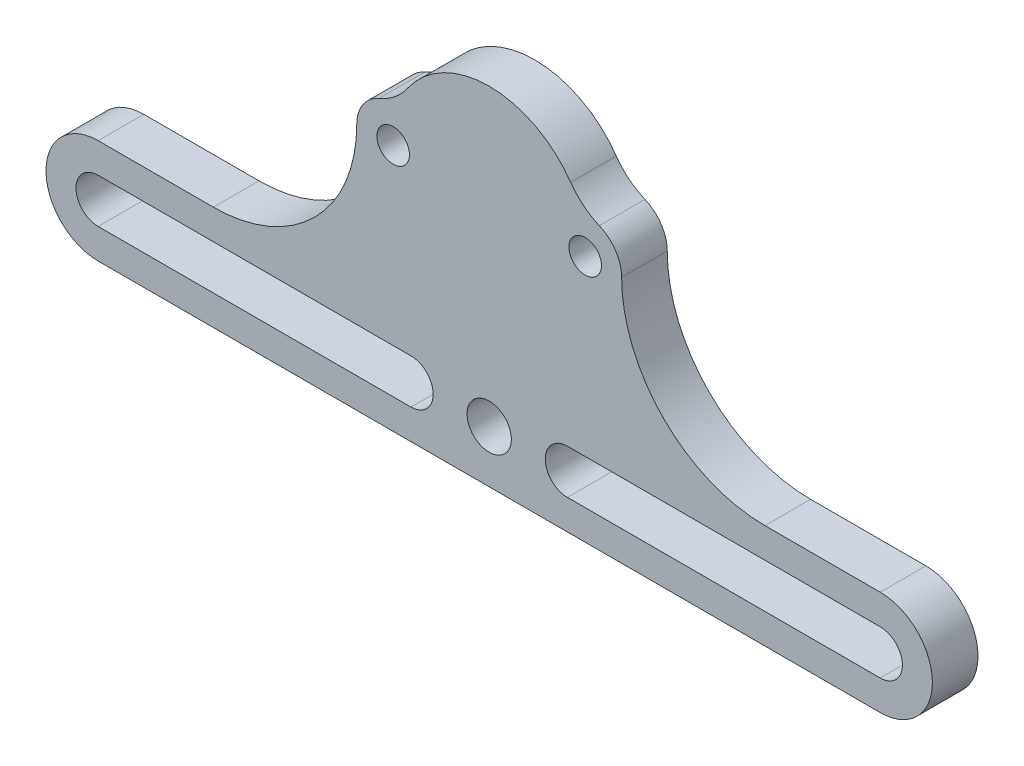
ISO-10303-21;
HEADER;
FILE_DESCRIPTION(('STEP AP214'),'2;1');
FILE_NAME('part.step','',(''),(''),'','','');
FILE_SCHEMA(('AUTOMOTIVE_DESIGN { 1 0 10303 214 1 1 1 1 }'));
ENDSEC;
DATA;
#1=APPLICATION_CONTEXT('core data for automotive mechanical design processes');
#2=APPLICATION_PROTOCOL_DEFINITION('international standard','automotive_design',2000,#1);
#3=PRODUCT_CONTEXT('',#1,'mechanical');
#4=PRODUCT('Part','Part','',(#3));
#5=PRODUCT_RELATED_PRODUCT_CATEGORY('part','',(#4));
#6=PRODUCT_DEFINITION_FORMATION('','',#4);
#7=PRODUCT_DEFINITION_CONTEXT('part definition',#1,'design');
#8=PRODUCT_DEFINITION('design','',#6,#7);
#9=PRODUCT_DEFINITION_SHAPE('','',#8);
#10=(LENGTH_UNIT() NAMED_UNIT(*) SI_UNIT(.MILLI.,.METRE.));
#11=(NAMED_UNIT(*) PLANE_ANGLE_UNIT() SI_UNIT($,.RADIAN.));
#12=(NAMED_UNIT(*) SI_UNIT($,.STERADIAN.) SOLID_ANGLE_UNIT());
#13=UNCERTAINTY_MEASURE_WITH_UNIT(LENGTH_MEASURE(1.E-05),#10,'distance_accuracy_value','');
#14=(GEOMETRIC_REPRESENTATION_CONTEXT(3) GLOBAL_UNCERTAINTY_ASSIGNED_CONTEXT((#13)) GLOBAL_UNIT_ASSIGNED_CONTEXT((#10,
#11,#12)) REPRESENTATION_CONTEXT('',''));
#15=CARTESIAN_POINT('',(0.,0.,0.));
#16=DIRECTION('',(0.,0.,1.));
#17=DIRECTION('',(1.,0.,0.));
#18=AXIS2_PLACEMENT_3D('',#15,#16,#17);
#19=CARTESIAN_POINT('',(-30.,-15.,3.50000000000001));
#20=DIRECTION('',(0.,0.,-1.));
#21=DIRECTION('',(-1.,0.,0.));
#22=AXIS2_PLACEMENT_3D('',#19,#20,#21);
#23=PLANE('',#22);
#24=CARTESIAN_POINT('',(-30.,-15.,3.50000000000001));
#25=DIRECTION('',(0.,0.,1.));
#26=DIRECTION('',(1.,0.,0.));
#27=AXIS2_PLACEMENT_3D('',#24,#25,#26);
#28=CIRCLE('',#27,1.7);
#29=CARTESIAN_POINT('',(-30.,-13.3,3.5));
#30=VERTEX_POINT('',#29);
#31=CARTESIAN_POINT('',(-30.,-16.7,3.50000000000001));
#32=VERTEX_POINT('',#31);
#33=EDGE_CURVE('E233',#30,#32,#28,.T.);
#34=ORIENTED_EDGE('',*,*,#33,.F.);
#35=DIRECTION('',(-1.,0.,0.));
#36=VECTOR('',#35,1.);
#37=CARTESIAN_POINT('',(-30.,-13.3,3.5));
#38=LINE('',#37,#36);
#39=CARTESIAN_POINT('',(-6.,-13.3,3.5));
#40=VERTEX_POINT('',#39);
#41=EDGE_CURVE('E244',#40,#30,#38,.T.);
#42=ORIENTED_EDGE('',*,*,#41,.F.);
#43=CARTESIAN_POINT('',(-6.00000000000001,-15.,3.5));
#44=DIRECTION('',(0.,0.,1.));
#45=DIRECTION('',(1.,0.,0.));
#46=AXIS2_PLACEMENT_3D('',#43,#44,#45);
#47=CIRCLE('',#46,1.7);
#48=CARTESIAN_POINT('',(-6.,-16.7,3.5));
#49=VERTEX_POINT('',#48);
#50=EDGE_CURVE('E240',#49,#40,#47,.T.);
#51=ORIENTED_EDGE('',*,*,#50,.F.);
#52=DIRECTION('',(1.,0.,0.));
#53=VECTOR('',#52,1.);
#54=CARTESIAN_POINT('',(-30.,-16.7,3.50000000000001));
#55=LINE('',#54,#53);
#56=EDGE_CURVE('E236',#32,#49,#55,.T.);
#57=ORIENTED_EDGE('',*,*,#56,.F.);
#58=EDGE_LOOP('',(#34,#42,#51,#57));
#59=FACE_BOUND('',#58,.T.);
#60=CARTESIAN_POINT('',(-30.,-15.,3.50000000000001));
#61=DIRECTION('',(0.,0.,1.));
#62=DIRECTION('',(-1.,0.,0.));
#63=AXIS2_PLACEMENT_3D('',#60,#61,#62);
#64=CIRCLE('',#63,4.);
#65=CARTESIAN_POINT('',(-30.,-11.,3.5));
#66=VERTEX_POINT('',#65);
#67=CARTESIAN_POINT('',(-30.,-19.,3.50000000000005));
#68=VERTEX_POINT('',#67);
#69=EDGE_CURVE('E292',#66,#68,#64,.T.);
#70=ORIENTED_EDGE('',*,*,#69,.T.);
#71=DIRECTION('',(1.,0.,0.));
#72=VECTOR('',#71,1.);
#73=CARTESIAN_POINT('',(-30.,-19.,3.50000000000005));
#74=LINE('',#73,#72);
#75=CARTESIAN_POINT('',(30.,-19.,3.5));
#76=VERTEX_POINT('',#75);
#77=EDGE_CURVE('E296',#68,#76,#74,.T.);
#78=ORIENTED_EDGE('',*,*,#77,.T.);
#79=CARTESIAN_POINT('',(30.,-15.0000000000001,3.5));
#80=DIRECTION('',(0.,0.,1.));
#81=DIRECTION('',(1.,0.,0.));
#82=AXIS2_PLACEMENT_3D('',#79,#80,#81);
#83=CIRCLE('',#82,4.);
#84=CARTESIAN_POINT('',(30.,-11.0000000000001,3.5));
#85=VERTEX_POINT('',#84);
#86=EDGE_CURVE('E300',#76,#85,#83,.T.);
#87=ORIENTED_EDGE('',*,*,#86,.T.);
#88=DIRECTION('',(-1.,0.,0.));
#89=VECTOR('',#88,1.);
#90=CARTESIAN_POINT('',(30.,-11.0000000000001,3.5));
#91=LINE('',#90,#89);
#92=CARTESIAN_POINT('',(21.1600000000001,-11.0000000000001,3.5));
#93=VERTEX_POINT('',#92);
#94=EDGE_CURVE('E303',#85,#93,#91,.T.);
#95=ORIENTED_EDGE('',*,*,#94,.T.);
#96=CARTESIAN_POINT('',(21.1600000000001,0.,3.5));
#97=DIRECTION('',(0.,0.,-1.));
#98=DIRECTION('',(-1.,0.,0.));
#99=AXIS2_PLACEMENT_3D('',#96,#97,#98);
#100=CIRCLE('',#99,11.0000000000001);
#101=CARTESIAN_POINT('',(10.16,0.,3.5));
#102=VERTEX_POINT('',#101);
#103=EDGE_CURVE('E306',#93,#102,#100,.T.);
#104=ORIENTED_EDGE('',*,*,#103,.T.);
#105=CARTESIAN_POINT('',(7.366,0.,3.5));
#106=DIRECTION('',(0.,0.,1.));
#107=DIRECTION('',(1.,0.,0.));
#108=AXIS2_PLACEMENT_3D('',#105,#106,#107);
#109=CIRCLE('',#108,2.794);
#110=CARTESIAN_POINT('',(8.45065628436315,2.57487023843755,3.5));
#111=VERTEX_POINT('',#110);
#112=EDGE_CURVE('E309',#102,#111,#109,.T.);
#113=ORIENTED_EDGE('',*,*,#112,.T.);
#114=CARTESIAN_POINT('',(10.4227586206897,7.25645248967009,3.5));
#115=DIRECTION('',(0.,0.,-1.));
#116=DIRECTION('',(1.,0.,0.));
#117=AXIS2_PLACEMENT_3D('',#114,#115,#116);
#118=CIRCLE('',#117,5.08000130660241);
#119=CARTESIAN_POINT('',(6.25365410024561,4.35387074703213,3.5));
#120=VERTEX_POINT('',#119);
#121=EDGE_CURVE('E312',#111,#120,#118,.T.);
#122=ORIENTED_EDGE('',*,*,#121,.T.);
#123=CARTESIAN_POINT('',(0.,0.,3.5));
#124=DIRECTION('',(0.,0.,1.));
#125=DIRECTION('',(1.,0.,0.));
#126=AXIS2_PLACEMENT_3D('',#123,#124,#125);
#127=CIRCLE('',#126,7.61999738679518);
#128=CARTESIAN_POINT('',(-6.25365302788954,4.3538700005321,3.5));
#129=VERTEX_POINT('',#128);
#130=EDGE_CURVE('E315',#120,#129,#127,.T.);
#131=ORIENTED_EDGE('',*,*,#130,.T.);
#132=CARTESIAN_POINT('',(-10.4227586206897,7.25645248967009,3.49999999999999));
#133=DIRECTION('',(0.,0.,-1.));
#134=DIRECTION('',(1.,0.,0.));
#135=AXIS2_PLACEMENT_3D('',#132,#133,#134);
#136=CIRCLE('',#135,5.08000361067499);
#137=CARTESIAN_POINT('',(-8.45065488236616,2.57486691106946,3.5));
#138=VERTEX_POINT('',#137);
#139=EDGE_CURVE('E318',#129,#138,#136,.T.);
#140=ORIENTED_EDGE('',*,*,#139,.T.);
#141=CARTESIAN_POINT('',(-7.366,0.,3.5));
#142=DIRECTION('',(0.,0.,1.));
#143=DIRECTION('',(1.,0.,0.));
#144=AXIS2_PLACEMENT_3D('',#141,#142,#143);
#145=CIRCLE('',#144,2.79399539185486);
#146=CARTESIAN_POINT('',(-10.1599953918549,0.,3.5));
#147=VERTEX_POINT('',#146);
#148=EDGE_CURVE('E321',#138,#147,#145,.T.);
#149=ORIENTED_EDGE('',*,*,#148,.T.);
#150=CARTESIAN_POINT('',(-21.1599953918549,0.,3.5));
#151=DIRECTION('',(0.,0.,-1.));
#152=DIRECTION('',(1.,0.,0.));
#153=AXIS2_PLACEMENT_3D('',#150,#151,#152);
#154=CIRCLE('',#153,11.0000000000001);
#155=CARTESIAN_POINT('',(-21.1599953918549,-11.,3.50000000000005));
#156=VERTEX_POINT('',#155);
#157=EDGE_CURVE('E324',#147,#156,#154,.T.);
#158=ORIENTED_EDGE('',*,*,#157,.T.);
#159=DIRECTION('',(-1.,0.,0.));
#160=VECTOR('',#159,1.);
#161=CARTESIAN_POINT('',(-30.,-11.,3.5));
#162=LINE('',#161,#160);
#163=EDGE_CURVE('E327',#156,#66,#162,.T.);
#164=ORIENTED_EDGE('',*,*,#163,.T.);
#165=EDGE_LOOP('',(#70,#78,#87,#95,#104,#113,#122,#131,#140,#149,#158,#164));
#166=FACE_BOUND('',#165,.T.);
#167=CARTESIAN_POINT('',(0.,-15.,3.5));
#168=DIRECTION('',(0.,0.,1.));
#169=DIRECTION('',(1.,0.,0.));
#170=AXIS2_PLACEMENT_3D('',#167,#168,#169);
#171=CIRCLE('',#170,1.7);
#172=CARTESIAN_POINT('',(1.7,-15.,3.5));
#173=VERTEX_POINT('',#172);
#174=EDGE_CURVE('E284',#173,#173,#171,.T.);
#175=ORIENTED_EDGE('',*,*,#174,.F.);
#176=EDGE_LOOP('',(#175));
#177=FACE_BOUND('',#176,.T.);
#178=CARTESIAN_POINT('',(7.366,0.,3.5));
#179=DIRECTION('',(0.,0.,1.));
#180=DIRECTION('',(1.,0.,0.));
#181=AXIS2_PLACEMENT_3D('',#178,#179,#180);
#182=CIRCLE('',#181,1.25);
#183=CARTESIAN_POINT('',(8.616,0.,3.5));
#184=VERTEX_POINT('',#183);
#185=EDGE_CURVE('E276',#184,#184,#182,.T.);
#186=ORIENTED_EDGE('',*,*,#185,.F.);
#187=EDGE_LOOP('',(#186));
#188=FACE_BOUND('',#187,.T.);
#189=CARTESIAN_POINT('',(30.,-15.0000000000001,3.5));
#190=DIRECTION('',(0.,0.,1.));
#191=DIRECTION('',(1.,0.,0.));
#192=AXIS2_PLACEMENT_3D('',#189,#190,#191);
#193=CIRCLE('',#192,1.7);
#194=CARTESIAN_POINT('',(30.,-16.7000000000001,3.5));
#195=VERTEX_POINT('',#194);
#196=CARTESIAN_POINT('',(30.,-13.3000000000001,3.5));
#197=VERTEX_POINT('',#196);
#198=EDGE_CURVE('E181',#195,#197,#193,.T.);
#199=ORIENTED_EDGE('',*,*,#198,.F.);
#200=DIRECTION('',(1.,0.,0.));
#201=VECTOR('',#200,1.);
#202=CARTESIAN_POINT('',(30.,-16.7000000000001,3.5));
#203=LINE('',#202,#201);
#204=CARTESIAN_POINT('',(6.00000000000001,-16.7,3.50000000000005));
#205=VERTEX_POINT('',#204);
#206=EDGE_CURVE('E209',#205,#195,#203,.T.);
#207=ORIENTED_EDGE('',*,*,#206,.F.);
#208=CARTESIAN_POINT('',(5.99999999999999,-15.,3.50000000000005));
#209=DIRECTION('',(0.,0.,1.));
#210=DIRECTION('',(1.,0.,0.));
#211=AXIS2_PLACEMENT_3D('',#208,#209,#210);
#212=CIRCLE('',#211,1.7);
#213=CARTESIAN_POINT('',(6.,-13.3,3.5));
#214=VERTEX_POINT('',#213);
#215=EDGE_CURVE('E204',#214,#205,#212,.T.);
#216=ORIENTED_EDGE('',*,*,#215,.F.);
#217=DIRECTION('',(-1.,0.,0.));
#218=VECTOR('',#217,1.);
#219=CARTESIAN_POINT('',(30.,-13.3000000000001,3.5));
#220=LINE('',#219,#218);
#221=EDGE_CURVE('E190',#197,#214,#220,.T.);
#222=ORIENTED_EDGE('',*,*,#221,.F.);
#223=EDGE_LOOP('',(#199,#207,#216,#222));
#224=FACE_BOUND('',#223,.T.);
#225=CARTESIAN_POINT('',(-7.366,0.,3.5));
#226=DIRECTION('',(0.,0.,1.));
#227=DIRECTION('',(1.,0.,0.));
#228=AXIS2_PLACEMENT_3D('',#225,#226,#227);
#229=CIRCLE('',#228,1.25);
#230=CARTESIAN_POINT('',(-6.116,0.,3.5));
#231=VERTEX_POINT('',#230);
#232=EDGE_CURVE('E217',#231,#231,#229,.T.);
#233=ORIENTED_EDGE('',*,*,#232,.F.);
#234=EDGE_LOOP('',(#233));
#235=FACE_BOUND('',#234,.T.);
#236=ADVANCED_FACE('F43',(#59,#166,#177,#188,#224,#235),#23,.F.);
#237=CARTESIAN_POINT('',(-30.,-15.,0.));
#238=DIRECTION('',(0.,0.,-1.));
#239=DIRECTION('',(-1.,0.,0.));
#240=AXIS2_PLACEMENT_3D('',#237,#238,#239);
#241=PLANE('',#240);
#242=DIRECTION('',(1.,0.,0.));
#243=VECTOR('',#242,1.);
#244=CARTESIAN_POINT('',(30.,-16.7000000000001,0.));
#245=LINE('',#244,#243);
#246=CARTESIAN_POINT('',(6.00000000000001,-16.7,0.));
#247=VERTEX_POINT('',#246);
#248=CARTESIAN_POINT('',(30.,-16.7000000000001,0.));
#249=VERTEX_POINT('',#248);
#250=EDGE_CURVE('E191',#247,#249,#245,.T.);
#251=ORIENTED_EDGE('',*,*,#250,.T.);
#252=CARTESIAN_POINT('',(30.,-15.0000000000001,0.));
#253=DIRECTION('',(0.,0.,1.));
#254=DIRECTION('',(1.,0.,0.));
#255=AXIS2_PLACEMENT_3D('',#252,#253,#254);
#256=CIRCLE('',#255,1.7);
#257=CARTESIAN_POINT('',(30.,-13.3000000000001,0.));
#258=VERTEX_POINT('',#257);
#259=EDGE_CURVE('E67',#249,#258,#256,.T.);
#260=ORIENTED_EDGE('',*,*,#259,.T.);
#261=DIRECTION('',(-1.,0.,0.));
#262=VECTOR('',#261,1.);
#263=CARTESIAN_POINT('',(30.,-13.3000000000001,0.));
#264=LINE('',#263,#262);
#265=CARTESIAN_POINT('',(6.00000000000001,-13.3,0.));
#266=VERTEX_POINT('',#265);
#267=EDGE_CURVE('E197',#258,#266,#264,.T.);
#268=ORIENTED_EDGE('',*,*,#267,.T.);
#269=CARTESIAN_POINT('',(6.,-15.,0.));
#270=DIRECTION('',(0.,0.,1.));
#271=DIRECTION('',(1.,0.,0.));
#272=AXIS2_PLACEMENT_3D('',#269,#270,#271);
#273=CIRCLE('',#272,1.7);
#274=EDGE_CURVE('E220',#266,#247,#273,.T.);
#275=ORIENTED_EDGE('',*,*,#274,.T.);
#276=EDGE_LOOP('',(#251,#260,#268,#275));
#277=FACE_BOUND('',#276,.T.);
#278=DIRECTION('',(-1.,0.,0.));
#279=VECTOR('',#278,1.);
#280=CARTESIAN_POINT('',(-30.,-13.3,0.));
#281=LINE('',#280,#279);
#282=CARTESIAN_POINT('',(-5.99999999999999,-13.3,0.));
#283=VERTEX_POINT('',#282);
#284=CARTESIAN_POINT('',(-30.,-13.3,0.));
#285=VERTEX_POINT('',#284);
#286=EDGE_CURVE('E237',#283,#285,#281,.T.);
#287=ORIENTED_EDGE('',*,*,#286,.T.);
#288=CARTESIAN_POINT('',(-30.,-15.,0.));
#289=DIRECTION('',(0.,0.,1.));
#290=DIRECTION('',(1.,0.,0.));
#291=AXIS2_PLACEMENT_3D('',#288,#289,#290);
#292=CIRCLE('',#291,1.7);
#293=CARTESIAN_POINT('',(-30.,-16.7,0.));
#294=VERTEX_POINT('',#293);
#295=EDGE_CURVE('E199',#285,#294,#292,.T.);
#296=ORIENTED_EDGE('',*,*,#295,.T.);
#297=DIRECTION('',(1.,0.,0.));
#298=VECTOR('',#297,1.);
#299=CARTESIAN_POINT('',(-30.,-16.7,0.));
#300=LINE('',#299,#298);
#301=CARTESIAN_POINT('',(-5.99999999999999,-16.7,0.));
#302=VERTEX_POINT('',#301);
#303=EDGE_CURVE('E251',#294,#302,#300,.T.);
#304=ORIENTED_EDGE('',*,*,#303,.T.);
#305=CARTESIAN_POINT('',(-6.,-15.,0.));
#306=DIRECTION('',(0.,0.,1.));
#307=DIRECTION('',(1.,0.,0.));
#308=AXIS2_PLACEMENT_3D('',#305,#306,#307);
#309=CIRCLE('',#308,1.7);
#310=EDGE_CURVE('E255',#302,#283,#309,.T.);
#311=ORIENTED_EDGE('',*,*,#310,.T.);
#312=EDGE_LOOP('',(#287,#296,#304,#311));
#313=FACE_BOUND('',#312,.T.);
#314=CARTESIAN_POINT('',(7.36600000000001,0.,0.));
#315=DIRECTION('',(0.,0.,1.));
#316=DIRECTION('',(1.,0.,0.));
#317=AXIS2_PLACEMENT_3D('',#314,#315,#316);
#318=CIRCLE('',#317,1.25);
#319=CARTESIAN_POINT('',(8.61600000000001,0.,0.));
#320=VERTEX_POINT('',#319);
#321=EDGE_CURVE('E275',#320,#320,#318,.T.);
#322=ORIENTED_EDGE('',*,*,#321,.T.);
#323=EDGE_LOOP('',(#322));
#324=FACE_BOUND('',#323,.T.);
#325=CARTESIAN_POINT('',(-30.,-15.,0.));
#326=DIRECTION('',(0.,0.,1.));
#327=DIRECTION('',(-1.,0.,0.));
#328=AXIS2_PLACEMENT_3D('',#325,#326,#327);
#329=CIRCLE('',#328,4.);
#330=CARTESIAN_POINT('',(-30.,-11.,0.));
#331=VERTEX_POINT('',#330);
#332=CARTESIAN_POINT('',(-30.,-19.,0.));
#333=VERTEX_POINT('',#332);
#334=EDGE_CURVE('E288',#331,#333,#329,.T.);
#335=ORIENTED_EDGE('',*,*,#334,.F.);
#336=DIRECTION('',(-1.,0.,0.));
#337=VECTOR('',#336,1.);
#338=CARTESIAN_POINT('',(-30.,-11.,0.));
#339=LINE('',#338,#337);
#340=CARTESIAN_POINT('',(-21.159995391855,-11.,0.));
#341=VERTEX_POINT('',#340);
#342=EDGE_CURVE('E297',#341,#331,#339,.T.);
#343=ORIENTED_EDGE('',*,*,#342,.F.);
#344=CARTESIAN_POINT('',(-21.1599953918549,0.,0.));
#345=DIRECTION('',(0.,0.,-1.));
#346=DIRECTION('',(1.,0.,0.));
#347=AXIS2_PLACEMENT_3D('',#344,#345,#346);
#348=CIRCLE('',#347,11.0000000000001);
#349=CARTESIAN_POINT('',(-10.1599953918549,0.,0.));
#350=VERTEX_POINT('',#349);
#351=EDGE_CURVE('E361',#350,#341,#348,.T.);
#352=ORIENTED_EDGE('',*,*,#351,.F.);
#353=CARTESIAN_POINT('',(-7.36599999999999,0.,0.));
#354=DIRECTION('',(0.,0.,1.));
#355=DIRECTION('',(1.,0.,0.));
#356=AXIS2_PLACEMENT_3D('',#353,#354,#355);
#357=CIRCLE('',#356,2.79399539185486);
#358=CARTESIAN_POINT('',(-8.45065488236617,2.57486691106946,0.));
#359=VERTEX_POINT('',#358);
#360=EDGE_CURVE('E358',#359,#350,#357,.T.);
#361=ORIENTED_EDGE('',*,*,#360,.F.);
#362=CARTESIAN_POINT('',(-10.4227586206897,7.25645248967009,0.));
#363=DIRECTION('',(0.,0.,-1.));
#364=DIRECTION('',(1.,0.,0.));
#365=AXIS2_PLACEMENT_3D('',#362,#363,#364);
#366=CIRCLE('',#365,5.08000361067499);
#367=CARTESIAN_POINT('',(-6.25365302788953,4.35387000053211,0.));
#368=VERTEX_POINT('',#367);
#369=EDGE_CURVE('E355',#368,#359,#366,.T.);
#370=ORIENTED_EDGE('',*,*,#369,.F.);
#371=CARTESIAN_POINT('',(0.,0.,0.));
#372=DIRECTION('',(0.,0.,1.));
#373=DIRECTION('',(1.,0.,0.));
#374=AXIS2_PLACEMENT_3D('',#371,#372,#373);
#375=CIRCLE('',#374,7.61999738679518);
#376=CARTESIAN_POINT('',(6.25365410024561,4.35387074703213,0.));
#377=VERTEX_POINT('',#376);
#378=EDGE_CURVE('E352',#377,#368,#375,.T.);
#379=ORIENTED_EDGE('',*,*,#378,.F.);
#380=CARTESIAN_POINT('',(10.4227586206897,7.25645248967009,0.));
#381=DIRECTION('',(0.,0.,-1.));
#382=DIRECTION('',(1.,0.,0.));
#383=AXIS2_PLACEMENT_3D('',#380,#381,#382);
#384=CIRCLE('',#383,5.08000130660241);
#385=CARTESIAN_POINT('',(8.45065628436315,2.57487023843755,0.));
#386=VERTEX_POINT('',#385);
#387=EDGE_CURVE('E349',#386,#377,#384,.T.);
#388=ORIENTED_EDGE('',*,*,#387,.F.);
#389=CARTESIAN_POINT('',(7.36600000000001,0.,0.));
#390=DIRECTION('',(0.,0.,1.));
#391=DIRECTION('',(1.,0.,0.));
#392=AXIS2_PLACEMENT_3D('',#389,#390,#391);
#393=CIRCLE('',#392,2.794);
#394=CARTESIAN_POINT('',(10.16,0.,0.));
#395=VERTEX_POINT('',#394);
#396=EDGE_CURVE('E346',#395,#386,#393,.T.);
#397=ORIENTED_EDGE('',*,*,#396,.F.);
#398=CARTESIAN_POINT('',(21.16,0.,0.));
#399=DIRECTION('',(0.,0.,-1.));
#400=DIRECTION('',(-1.,0.,0.));
#401=AXIS2_PLACEMENT_3D('',#398,#399,#400);
#402=CIRCLE('',#401,11.0000000000001);
#403=CARTESIAN_POINT('',(21.16,-11.,0.));
#404=VERTEX_POINT('',#403);
#405=EDGE_CURVE('E343',#404,#395,#402,.T.);
#406=ORIENTED_EDGE('',*,*,#405,.F.);
#407=DIRECTION('',(-1.,0.,0.));
#408=VECTOR('',#407,1.);
#409=CARTESIAN_POINT('',(30.,-11.0000000000001,0.));
#410=LINE('',#409,#408);
#411=CARTESIAN_POINT('',(30.,-11.0000000000001,0.));
#412=VERTEX_POINT('',#411);
#413=EDGE_CURVE('E340',#412,#404,#410,.T.);
#414=ORIENTED_EDGE('',*,*,#413,.F.);
#415=CARTESIAN_POINT('',(30.,-15.0000000000001,0.));
#416=DIRECTION('',(0.,0.,1.));
#417=DIRECTION('',(1.,0.,0.));
#418=AXIS2_PLACEMENT_3D('',#415,#416,#417);
#419=CIRCLE('',#418,4.);
#420=CARTESIAN_POINT('',(30.,-19.,0.));
#421=VERTEX_POINT('',#420);
#422=EDGE_CURVE('E337',#421,#412,#419,.T.);
#423=ORIENTED_EDGE('',*,*,#422,.F.);
#424=DIRECTION('',(1.,0.,0.));
#425=VECTOR('',#424,1.);
#426=CARTESIAN_POINT('',(-30.,-19.,0.));
#427=LINE('',#426,#425);
#428=EDGE_CURVE('E334',#333,#421,#427,.T.);
#429=ORIENTED_EDGE('',*,*,#428,.F.);
#430=EDGE_LOOP('',(#335,#343,#352,#361,#370,#379,#388,#397,#406,#414,#423,#429));
#431=FACE_BOUND('',#430,.T.);
#432=CARTESIAN_POINT('',(0.,-15.,0.));
#433=DIRECTION('',(0.,0.,1.));
#434=DIRECTION('',(1.,0.,0.));
#435=AXIS2_PLACEMENT_3D('',#432,#433,#434);
#436=CIRCLE('',#435,1.7);
#437=CARTESIAN_POINT('',(1.7,-15.,0.));
#438=VERTEX_POINT('',#437);
#439=EDGE_CURVE('E280',#438,#438,#436,.T.);
#440=ORIENTED_EDGE('',*,*,#439,.T.);
#441=EDGE_LOOP('',(#440));
#442=FACE_BOUND('',#441,.T.);
#443=CARTESIAN_POINT('',(-7.36599999999999,0.,0.));
#444=DIRECTION('',(0.,0.,1.));
#445=DIRECTION('',(1.,0.,0.));
#446=AXIS2_PLACEMENT_3D('',#443,#444,#445);
#447=CIRCLE('',#446,1.25);
#448=CARTESIAN_POINT('',(-6.11599999999999,0.,0.));
#449=VERTEX_POINT('',#448);
#450=EDGE_CURVE('E692',#449,#449,#447,.T.);
#451=ORIENTED_EDGE('',*,*,#450,.T.);
#452=EDGE_LOOP('',(#451));
#453=FACE_BOUND('',#452,.T.);
#454=ADVANCED_FACE('F417',(#277,#313,#324,#431,#442,#453),#241,.T.);
#455=CARTESIAN_POINT('',(-30.,-15.,3.50000000000001));
#456=DIRECTION('',(0.,0.,-1.));
#457=DIRECTION('',(-1.,0.,0.));
#458=AXIS2_PLACEMENT_3D('',#455,#456,#457);
#459=CYLINDRICAL_SURFACE('',#458,4.);
#460=ORIENTED_EDGE('',*,*,#334,.T.);
#461=DIRECTION('',(0.,0.,-1.));
#462=VECTOR('',#461,1.);
#463=CARTESIAN_POINT('',(-30.,-19.,3.50000000000005));
#464=LINE('',#463,#462);
#465=EDGE_CURVE('E11',#68,#333,#464,.T.);
#466=ORIENTED_EDGE('',*,*,#465,.F.);
#467=ORIENTED_EDGE('',*,*,#69,.F.);
#468=DIRECTION('',(0.,0.,-1.));
#469=VECTOR('',#468,1.);
#470=CARTESIAN_POINT('',(-30.,-11.,3.5));
#471=LINE('',#470,#469);
#472=EDGE_CURVE('E330',#66,#331,#471,.T.);
#473=ORIENTED_EDGE('',*,*,#472,.T.);
#474=EDGE_LOOP('',(#460,#466,#467,#473));
#475=FACE_BOUND('',#474,.T.);
#476=ADVANCED_FACE('F45',(#475),#459,.T.);
#477=CARTESIAN_POINT('',(-30.,-19.,3.50000000000005));
#478=DIRECTION('',(0.,1.,0.));
#479=DIRECTION('',(0.,0.,1.));
#480=AXIS2_PLACEMENT_3D('',#477,#478,#479);
#481=PLANE('',#480);
#482=ORIENTED_EDGE('',*,*,#428,.T.);
#483=DIRECTION('',(0.,0.,-1.));
#484=VECTOR('',#483,1.);
#485=CARTESIAN_POINT('',(30.,-19.,3.5));
#486=LINE('',#485,#484);
#487=EDGE_CURVE('E52',#76,#421,#486,.T.);
#488=ORIENTED_EDGE('',*,*,#487,.F.);
#489=ORIENTED_EDGE('',*,*,#77,.F.);
#490=ORIENTED_EDGE('',*,*,#465,.T.);
#491=EDGE_LOOP('',(#482,#488,#489,#490));
#492=FACE_BOUND('',#491,.T.);
#493=ADVANCED_FACE('F435',(#492),#481,.F.);
#494=CARTESIAN_POINT('',(30.,-15.0000000000001,3.5));
#495=DIRECTION('',(0.,0.,-1.));
#496=DIRECTION('',(-1.,0.,0.));
#497=AXIS2_PLACEMENT_3D('',#494,#495,#496);
#498=CYLINDRICAL_SURFACE('',#497,4.);
#499=ORIENTED_EDGE('',*,*,#422,.T.);
#500=DIRECTION('',(0.,0.,-1.));
#501=VECTOR('',#500,1.);
#502=CARTESIAN_POINT('',(30.,-11.0000000000001,3.5));
#503=LINE('',#502,#501);
#504=EDGE_CURVE('E401',#85,#412,#503,.T.);
#505=ORIENTED_EDGE('',*,*,#504,.F.);
#506=ORIENTED_EDGE('',*,*,#86,.F.);
#507=ORIENTED_EDGE('',*,*,#487,.T.);
#508=EDGE_LOOP('',(#499,#505,#506,#507));
#509=FACE_BOUND('',#508,.T.);
#510=ADVANCED_FACE('F411',(#509),#498,.T.);
#511=CARTESIAN_POINT('',(30.,-11.0000000000001,3.5));
#512=DIRECTION('',(0.,-1.,0.));
#513=DIRECTION('',(0.,0.,-1.));
#514=AXIS2_PLACEMENT_3D('',#511,#512,#513);
#515=PLANE('',#514);
#516=ORIENTED_EDGE('',*,*,#413,.T.);
#517=DIRECTION('',(0.,0.,-1.));
#518=VECTOR('',#517,1.);
#519=CARTESIAN_POINT('',(21.1600000000001,-11.0000000000001,3.5));
#520=LINE('',#519,#518);
#521=EDGE_CURVE('E397',#93,#404,#520,.T.);
#522=ORIENTED_EDGE('',*,*,#521,.F.);
#523=ORIENTED_EDGE('',*,*,#94,.F.);
#524=ORIENTED_EDGE('',*,*,#504,.T.);
#525=EDGE_LOOP('',(#516,#522,#523,#524));
#526=FACE_BOUND('',#525,.T.);
#527=ADVANCED_FACE('F423',(#526),#515,.F.);
#528=CARTESIAN_POINT('',(21.1600000000001,0.,3.5));
#529=DIRECTION('',(0.,0.,-1.));
#530=DIRECTION('',(-1.,0.,0.));
#531=AXIS2_PLACEMENT_3D('',#528,#529,#530);
#532=CYLINDRICAL_SURFACE('',#531,11.0000000000001);
#533=ORIENTED_EDGE('',*,*,#405,.T.);
#534=DIRECTION('',(0.,0.,-1.));
#535=VECTOR('',#534,1.);
#536=CARTESIAN_POINT('',(10.16,0.,3.5));
#537=LINE('',#536,#535);
#538=EDGE_CURVE('E393',#102,#395,#537,.T.);
#539=ORIENTED_EDGE('',*,*,#538,.F.);
#540=ORIENTED_EDGE('',*,*,#103,.F.);
#541=ORIENTED_EDGE('',*,*,#521,.T.);
#542=EDGE_LOOP('',(#533,#539,#540,#541));
#543=FACE_BOUND('',#542,.T.);
#544=ADVANCED_FACE('F427',(#543),#532,.F.);
#545=CARTESIAN_POINT('',(7.366,0.,3.5));
#546=DIRECTION('',(0.,0.,-1.));
#547=DIRECTION('',(-1.,0.,0.));
#548=AXIS2_PLACEMENT_3D('',#545,#546,#547);
#549=CYLINDRICAL_SURFACE('',#548,2.794);
#550=ORIENTED_EDGE('',*,*,#396,.T.);
#551=DIRECTION('',(0.,0.,-1.));
#552=VECTOR('',#551,1.);
#553=CARTESIAN_POINT('',(8.45065628436315,2.57487023843755,3.5));
#554=LINE('',#553,#552);
#555=EDGE_CURVE('E389',#111,#386,#554,.T.);
#556=ORIENTED_EDGE('',*,*,#555,.F.);
#557=ORIENTED_EDGE('',*,*,#112,.F.);
#558=ORIENTED_EDGE('',*,*,#538,.T.);
#559=EDGE_LOOP('',(#550,#556,#557,#558));
#560=FACE_BOUND('',#559,.T.);
#561=ADVANCED_FACE('F468',(#560),#549,.T.);
#562=CARTESIAN_POINT('',(10.4227586206897,7.25645248967009,3.5));
#563=DIRECTION('',(0.,0.,-1.));
#564=DIRECTION('',(-1.,0.,0.));
#565=AXIS2_PLACEMENT_3D('',#562,#563,#564);
#566=CYLINDRICAL_SURFACE('',#565,5.08000130660241);
#567=ORIENTED_EDGE('',*,*,#387,.T.);
#568=DIRECTION('',(0.,0.,-1.));
#569=VECTOR('',#568,1.);
#570=CARTESIAN_POINT('',(6.25365410024561,4.35387074703213,3.5));
#571=LINE('',#570,#569);
#572=EDGE_CURVE('E385',#120,#377,#571,.T.);
#573=ORIENTED_EDGE('',*,*,#572,.F.);
#574=ORIENTED_EDGE('',*,*,#121,.F.);
#575=ORIENTED_EDGE('',*,*,#555,.T.);
#576=EDGE_LOOP('',(#567,#573,#574,#575));
#577=FACE_BOUND('',#576,.T.);
#578=ADVANCED_FACE('F466',(#577),#566,.F.);
#579=CARTESIAN_POINT('',(0.,0.,3.5));
#580=DIRECTION('',(0.,0.,-1.));
#581=DIRECTION('',(-1.,0.,0.));
#582=AXIS2_PLACEMENT_3D('',#579,#580,#581);
#583=CYLINDRICAL_SURFACE('',#582,7.61999738679518);
#584=ORIENTED_EDGE('',*,*,#378,.T.);
#585=DIRECTION('',(0.,0.,-1.));
#586=VECTOR('',#585,1.);
#587=CARTESIAN_POINT('',(-6.25365302788954,4.3538700005321,3.5));
#588=LINE('',#587,#586);
#589=EDGE_CURVE('E381',#129,#368,#588,.T.);
#590=ORIENTED_EDGE('',*,*,#589,.F.);
#591=ORIENTED_EDGE('',*,*,#130,.F.);
#592=ORIENTED_EDGE('',*,*,#572,.T.);
#593=EDGE_LOOP('',(#584,#590,#591,#592));
#594=FACE_BOUND('',#593,.T.);
#595=ADVANCED_FACE('F462',(#594),#583,.T.);
#596=CARTESIAN_POINT('',(-10.4227586206897,7.25645248967009,3.49999999999999));
#597=DIRECTION('',(0.,0.,-1.));
#598=DIRECTION('',(-1.,0.,0.));
#599=AXIS2_PLACEMENT_3D('',#596,#597,#598);
#600=CYLINDRICAL_SURFACE('',#599,5.08000361067499);
#601=ORIENTED_EDGE('',*,*,#369,.T.);
#602=DIRECTION('',(0.,0.,-1.));
#603=VECTOR('',#602,1.);
#604=CARTESIAN_POINT('',(-8.45065488236616,2.57486691106946,3.5));
#605=LINE('',#604,#603);
#606=EDGE_CURVE('E377',#138,#359,#605,.T.);
#607=ORIENTED_EDGE('',*,*,#606,.F.);
#608=ORIENTED_EDGE('',*,*,#139,.F.);
#609=ORIENTED_EDGE('',*,*,#589,.T.);
#610=EDGE_LOOP('',(#601,#607,#608,#609));
#611=FACE_BOUND('',#610,.T.);
#612=ADVANCED_FACE('F457',(#611),#600,.F.);
#613=CARTESIAN_POINT('',(-7.366,0.,3.5));
#614=DIRECTION('',(0.,0.,-1.));
#615=DIRECTION('',(-1.,0.,0.));
#616=AXIS2_PLACEMENT_3D('',#613,#614,#615);
#617=CYLINDRICAL_SURFACE('',#616,2.79399539185486);
#618=ORIENTED_EDGE('',*,*,#360,.T.);
#619=DIRECTION('',(0.,0.,-1.));
#620=VECTOR('',#619,1.);
#621=CARTESIAN_POINT('',(-10.1599953918549,0.,3.5));
#622=LINE('',#621,#620);
#623=EDGE_CURVE('E373',#147,#350,#622,.T.);
#624=ORIENTED_EDGE('',*,*,#623,.F.);
#625=ORIENTED_EDGE('',*,*,#148,.F.);
#626=ORIENTED_EDGE('',*,*,#606,.T.);
#627=EDGE_LOOP('',(#618,#624,#625,#626));
#628=FACE_BOUND('',#627,.T.);
#629=ADVANCED_FACE('F451',(#628),#617,.T.);
#630=CARTESIAN_POINT('',(-21.1599953918549,0.,3.5));
#631=DIRECTION('',(0.,0.,-1.));
#632=DIRECTION('',(-1.,0.,0.));
#633=AXIS2_PLACEMENT_3D('',#630,#631,#632);
#634=CYLINDRICAL_SURFACE('',#633,11.0000000000001);
#635=ORIENTED_EDGE('',*,*,#351,.T.);
#636=DIRECTION('',(0.,0.,-1.));
#637=VECTOR('',#636,1.);
#638=CARTESIAN_POINT('',(-21.1599953918549,-11.,3.50000000000005));
#639=LINE('',#638,#637);
#640=EDGE_CURVE('E369',#156,#341,#639,.T.);
#641=ORIENTED_EDGE('',*,*,#640,.F.);
#642=ORIENTED_EDGE('',*,*,#157,.F.);
#643=ORIENTED_EDGE('',*,*,#623,.T.);
#644=EDGE_LOOP('',(#635,#641,#642,#643));
#645=FACE_BOUND('',#644,.T.);
#646=ADVANCED_FACE('F447',(#645),#634,.F.);
#647=CARTESIAN_POINT('',(-30.,-11.,3.5));
#648=DIRECTION('',(0.,-1.,0.));
#649=DIRECTION('',(1.,0.,0.));
#650=AXIS2_PLACEMENT_3D('',#647,#648,#649);
#651=PLANE('',#650);
#652=ORIENTED_EDGE('',*,*,#342,.T.);
#653=ORIENTED_EDGE('',*,*,#472,.F.);
#654=ORIENTED_EDGE('',*,*,#163,.F.);
#655=ORIENTED_EDGE('',*,*,#640,.T.);
#656=EDGE_LOOP('',(#652,#653,#654,#655));
#657=FACE_BOUND('',#656,.T.);
#658=ADVANCED_FACE('F442',(#657),#651,.F.);
#659=CARTESIAN_POINT('',(0.,-15.,3.5));
#660=DIRECTION('',(0.,0.,-1.));
#661=DIRECTION('',(-1.,0.,0.));
#662=AXIS2_PLACEMENT_3D('',#659,#660,#661);
#663=CYLINDRICAL_SURFACE('',#662,1.7);
#664=ORIENTED_EDGE('',*,*,#174,.T.);
#665=EDGE_LOOP('',(#664));
#666=FACE_BOUND('',#665,.T.);
#667=ORIENTED_EDGE('',*,*,#439,.F.);
#668=EDGE_LOOP('',(#667));
#669=FACE_BOUND('',#668,.T.);
#670=ADVANCED_FACE('F487',(#666,#669),#663,.F.);
#671=CARTESIAN_POINT('',(7.366,0.,3.5));
#672=DIRECTION('',(0.,0.,-1.));
#673=DIRECTION('',(-1.,0.,0.));
#674=AXIS2_PLACEMENT_3D('',#671,#672,#673);
#675=CYLINDRICAL_SURFACE('',#674,1.25);
#676=ORIENTED_EDGE('',*,*,#185,.T.);
#677=EDGE_LOOP('',(#676));
#678=FACE_BOUND('',#677,.T.);
#679=ORIENTED_EDGE('',*,*,#321,.F.);
#680=EDGE_LOOP('',(#679));
#681=FACE_BOUND('',#680,.T.);
#682=ADVANCED_FACE('F525',(#678,#681),#675,.F.);
#683=CARTESIAN_POINT('',(-30.,-15.,3.50000000000001));
#684=DIRECTION('',(0.,0.,-1.));
#685=DIRECTION('',(-1.,0.,0.));
#686=AXIS2_PLACEMENT_3D('',#683,#684,#685);
#687=CYLINDRICAL_SURFACE('',#686,1.7);
#688=ORIENTED_EDGE('',*,*,#295,.F.);
#689=DIRECTION('',(0.,0.,-1.));
#690=VECTOR('',#689,1.);
#691=CARTESIAN_POINT('',(-30.,-13.3,3.5));
#692=LINE('',#691,#690);
#693=EDGE_CURVE('E247',#30,#285,#692,.T.);
#694=ORIENTED_EDGE('',*,*,#693,.F.);
#695=ORIENTED_EDGE('',*,*,#33,.T.);
#696=DIRECTION('',(0.,0.,-1.));
#697=VECTOR('',#696,1.);
#698=CARTESIAN_POINT('',(-30.,-16.7,3.50000000000001));
#699=LINE('',#698,#697);
#700=EDGE_CURVE('E271',#32,#294,#699,.T.);
#701=ORIENTED_EDGE('',*,*,#700,.T.);
#702=EDGE_LOOP('',(#688,#694,#695,#701));
#703=FACE_BOUND('',#702,.T.);
#704=ADVANCED_FACE('F532',(#703),#687,.F.);
#705=CARTESIAN_POINT('',(-30.,-16.7,3.50000000000001));
#706=DIRECTION('',(0.,1.,0.));
#707=DIRECTION('',(0.,0.,1.));
#708=AXIS2_PLACEMENT_3D('',#705,#706,#707);
#709=PLANE('',#708);
#710=ORIENTED_EDGE('',*,*,#303,.F.);
#711=ORIENTED_EDGE('',*,*,#700,.F.);
#712=ORIENTED_EDGE('',*,*,#56,.T.);
#713=DIRECTION('',(0.,0.,-1.));
#714=VECTOR('',#713,1.);
#715=CARTESIAN_POINT('',(-6.,-16.7,3.5));
#716=LINE('',#715,#714);
#717=EDGE_CURVE('E268',#49,#302,#716,.T.);
#718=ORIENTED_EDGE('',*,*,#717,.T.);
#719=EDGE_LOOP('',(#710,#711,#712,#718));
#720=FACE_BOUND('',#719,.T.);
#721=ADVANCED_FACE('F539',(#720),#709,.T.);
#722=CARTESIAN_POINT('',(-6.00000000000001,-15.,3.5));
#723=DIRECTION('',(0.,0.,-1.));
#724=DIRECTION('',(-1.,0.,0.));
#725=AXIS2_PLACEMENT_3D('',#722,#723,#724);
#726=CYLINDRICAL_SURFACE('',#725,1.7);
#727=ORIENTED_EDGE('',*,*,#310,.F.);
#728=ORIENTED_EDGE('',*,*,#717,.F.);
#729=ORIENTED_EDGE('',*,*,#50,.T.);
#730=DIRECTION('',(0.,0.,-1.));
#731=VECTOR('',#730,1.);
#732=CARTESIAN_POINT('',(-6.,-13.3,3.5));
#733=LINE('',#732,#731);
#734=EDGE_CURVE('E265',#40,#283,#733,.T.);
#735=ORIENTED_EDGE('',*,*,#734,.T.);
#736=EDGE_LOOP('',(#727,#728,#729,#735));
#737=FACE_BOUND('',#736,.T.);
#738=ADVANCED_FACE('F547',(#737),#726,.F.);
#739=CARTESIAN_POINT('',(-30.,-13.3,3.5));
#740=DIRECTION('',(0.,-1.,0.));
#741=DIRECTION('',(0.,0.,-1.));
#742=AXIS2_PLACEMENT_3D('',#739,#740,#741);
#743=PLANE('',#742);
#744=ORIENTED_EDGE('',*,*,#286,.F.);
#745=ORIENTED_EDGE('',*,*,#734,.F.);
#746=ORIENTED_EDGE('',*,*,#41,.T.);
#747=ORIENTED_EDGE('',*,*,#693,.T.);
#748=EDGE_LOOP('',(#744,#745,#746,#747));
#749=FACE_BOUND('',#748,.T.);
#750=ADVANCED_FACE('F555',(#749),#743,.T.);
#751=CARTESIAN_POINT('',(30.,-15.0000000000001,3.5));
#752=DIRECTION('',(0.,0.,-1.));
#753=DIRECTION('',(-1.,0.,0.));
#754=AXIS2_PLACEMENT_3D('',#751,#752,#753);
#755=CYLINDRICAL_SURFACE('',#754,1.7);
#756=ORIENTED_EDGE('',*,*,#259,.F.);
#757=DIRECTION('',(0.,0.,-1.));
#758=VECTOR('',#757,1.);
#759=CARTESIAN_POINT('',(30.,-16.7000000000001,3.5));
#760=LINE('',#759,#758);
#761=EDGE_CURVE('E185',#195,#249,#760,.T.);
#762=ORIENTED_EDGE('',*,*,#761,.F.);
#763=ORIENTED_EDGE('',*,*,#198,.T.);
#764=DIRECTION('',(0.,0.,-1.));
#765=VECTOR('',#764,1.);
#766=CARTESIAN_POINT('',(30.,-13.3000000000001,3.5));
#767=LINE('',#766,#765);
#768=EDGE_CURVE('E184',#197,#258,#767,.T.);
#769=ORIENTED_EDGE('',*,*,#768,.T.);
#770=EDGE_LOOP('',(#756,#762,#763,#769));
#771=FACE_BOUND('',#770,.T.);
#772=ADVANCED_FACE('F183',(#771),#755,.F.);
#773=CARTESIAN_POINT('',(30.,-13.3000000000001,3.5));
#774=DIRECTION('',(0.,-1.,0.));
#775=DIRECTION('',(0.,0.,-1.));
#776=AXIS2_PLACEMENT_3D('',#773,#774,#775);
#777=PLANE('',#776);
#778=ORIENTED_EDGE('',*,*,#267,.F.);
#779=ORIENTED_EDGE('',*,*,#768,.F.);
#780=ORIENTED_EDGE('',*,*,#221,.T.);
#781=DIRECTION('',(0.,0.,-1.));
#782=VECTOR('',#781,1.);
#783=CARTESIAN_POINT('',(6.,-13.3,3.5));
#784=LINE('',#783,#782);
#785=EDGE_CURVE('E200',#214,#266,#784,.T.);
#786=ORIENTED_EDGE('',*,*,#785,.T.);
#787=EDGE_LOOP('',(#778,#779,#780,#786));
#788=FACE_BOUND('',#787,.T.);
#789=ADVANCED_FACE('F194',(#788),#777,.T.);
#790=CARTESIAN_POINT('',(5.99999999999999,-15.,3.50000000000005));
#791=DIRECTION('',(0.,0.,-1.));
#792=DIRECTION('',(-1.,0.,0.));
#793=AXIS2_PLACEMENT_3D('',#790,#791,#792);
#794=CYLINDRICAL_SURFACE('',#793,1.7);
#795=ORIENTED_EDGE('',*,*,#274,.F.);
#796=ORIENTED_EDGE('',*,*,#785,.F.);
#797=ORIENTED_EDGE('',*,*,#215,.T.);
#798=DIRECTION('',(0.,0.,-1.));
#799=VECTOR('',#798,1.);
#800=CARTESIAN_POINT('',(6.,-16.7,3.50000000000005));
#801=LINE('',#800,#799);
#802=EDGE_CURVE('E59',#205,#247,#801,.T.);
#803=ORIENTED_EDGE('',*,*,#802,.T.);
#804=EDGE_LOOP('',(#795,#796,#797,#803));
#805=FACE_BOUND('',#804,.T.);
#806=ADVANCED_FACE('F576',(#805),#794,.F.);
#807=CARTESIAN_POINT('',(30.,-16.7000000000001,3.5));
#808=DIRECTION('',(0.,1.,0.));
#809=DIRECTION('',(0.,0.,1.));
#810=AXIS2_PLACEMENT_3D('',#807,#808,#809);
#811=PLANE('',#810);
#812=ORIENTED_EDGE('',*,*,#250,.F.);
#813=ORIENTED_EDGE('',*,*,#802,.F.);
#814=ORIENTED_EDGE('',*,*,#206,.T.);
#815=ORIENTED_EDGE('',*,*,#761,.T.);
#816=EDGE_LOOP('',(#812,#813,#814,#815));
#817=FACE_BOUND('',#816,.T.);
#818=ADVANCED_FACE('F583',(#817),#811,.T.);
#819=CARTESIAN_POINT('',(-7.366,0.,3.5));
#820=DIRECTION('',(0.,0.,-1.));
#821=DIRECTION('',(-1.,0.,0.));
#822=AXIS2_PLACEMENT_3D('',#819,#820,#821);
#823=CYLINDRICAL_SURFACE('',#822,1.25);
#824=ORIENTED_EDGE('',*,*,#232,.T.);
#825=EDGE_LOOP('',(#824));
#826=FACE_BOUND('',#825,.T.);
#827=ORIENTED_EDGE('',*,*,#450,.F.);
#828=EDGE_LOOP('',(#827));
#829=FACE_BOUND('',#828,.T.);
#830=ADVANCED_FACE('F591',(#826,#829),#823,.F.);
#831=CLOSED_SHELL('',(#236,#454,#476,#493,#510,#527,#544,#561,#578,#595,#612,#629,#646,#658,
#670,#682,#704,#721,#738,#750,#772,#789,#806,#818,#830));
#832=MANIFOLD_SOLID_BREP('B2',#831);
#833=ADVANCED_BREP_SHAPE_REPRESENTATION('',(#18,#832),#14);
#834=SHAPE_DEFINITION_REPRESENTATION(#9,#833);
ENDSEC;
END-ISO-10303-21;
